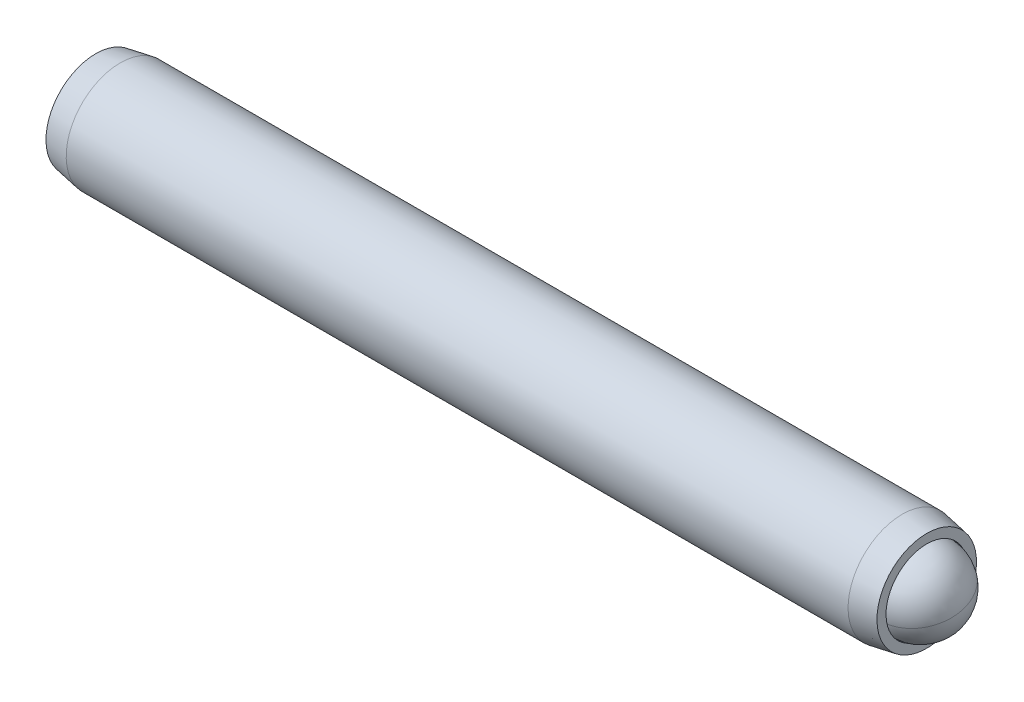
ISO-10303-21;
HEADER;
FILE_DESCRIPTION(('STEP AP214'),'2;1');
FILE_NAME('part.step','',(''),(''),'','','');
FILE_SCHEMA(('AUTOMOTIVE_DESIGN { 1 0 10303 214 1 1 1 1 }'));
ENDSEC;
DATA;
#1=APPLICATION_CONTEXT('core data for automotive mechanical design processes');
#2=APPLICATION_PROTOCOL_DEFINITION('international standard','automotive_design',2000,#1);
#3=PRODUCT_CONTEXT('',#1,'mechanical');
#4=PRODUCT('Part','Part','',(#3));
#5=PRODUCT_RELATED_PRODUCT_CATEGORY('part','',(#4));
#6=PRODUCT_DEFINITION_FORMATION('','',#4);
#7=PRODUCT_DEFINITION_CONTEXT('part definition',#1,'design');
#8=PRODUCT_DEFINITION('design','',#6,#7);
#9=PRODUCT_DEFINITION_SHAPE('','',#8);
#10=(LENGTH_UNIT() NAMED_UNIT(*) SI_UNIT(.MILLI.,.METRE.));
#11=(NAMED_UNIT(*) PLANE_ANGLE_UNIT() SI_UNIT($,.RADIAN.));
#12=(NAMED_UNIT(*) SI_UNIT($,.STERADIAN.) SOLID_ANGLE_UNIT());
#13=UNCERTAINTY_MEASURE_WITH_UNIT(LENGTH_MEASURE(1.E-05),#10,'distance_accuracy_value','');
#14=(GEOMETRIC_REPRESENTATION_CONTEXT(3) GLOBAL_UNCERTAINTY_ASSIGNED_CONTEXT((#13)) GLOBAL_UNIT_ASSIGNED_CONTEXT((#10,
#11,#12)) REPRESENTATION_CONTEXT('',''));
#15=CARTESIAN_POINT('',(0.,0.,0.));
#16=DIRECTION('',(0.,0.,1.));
#17=DIRECTION('',(1.,0.,0.));
#18=AXIS2_PLACEMENT_3D('',#15,#16,#17);
#19=CARTESIAN_POINT('',(-27.1013459470191,2.74204998828509,-0.965131231055238));
#20=DIRECTION('',(-1.,0.,0.));
#21=DIRECTION('',(0.,-1.,0.));
#22=AXIS2_PLACEMENT_3D('',#19,#20,#21);
#23=PLANE('',#22);
#24=DIRECTION('',(0.,0.866025403784439,-0.5));
#25=VECTOR('',#24,1.);
#26=CARTESIAN_POINT('',(-27.1013459470191,2.61504998828509,-2.33078112403965));
#27=LINE('',#26,#25);
#28=CARTESIAN_POINT('',(-27.1013459470191,1.49586248828509,-1.68461791964098));
#29=VERTEX_POINT('',#28);
#30=CARTESIAN_POINT('',(-27.1013459470191,2.74204998828508,-2.40410460822673));
#31=VERTEX_POINT('',#30);
#32=EDGE_CURVE('P0_E164',#29,#31,#27,.T.);
#33=ORIENTED_EDGE('',*,*,#32,.T.);
#34=DIRECTION('',(0.,0.866025403784439,0.5));
#35=VECTOR('',#34,1.);
#36=CARTESIAN_POINT('',(-27.1013459470191,3.86123748828508,-1.75794140382807));
#37=LINE('',#36,#35);
#38=CARTESIAN_POINT('',(-27.1013459470191,3.98823748828508,-1.68461791964098));
#39=VERTEX_POINT('',#38);
#40=EDGE_CURVE('P0_E166',#31,#39,#37,.T.);
#41=ORIENTED_EDGE('',*,*,#40,.T.);
#42=DIRECTION('',(0.,0.,1.));
#43=VECTOR('',#42,1.);
#44=CARTESIAN_POINT('',(-27.1013459470191,3.98823748828508,-0.392291510843657));
#45=LINE('',#44,#43);
#46=CARTESIAN_POINT('',(-27.1013459470191,3.98823748828508,-0.245644542469494));
#47=VERTEX_POINT('',#46);
#48=EDGE_CURVE('P0_E156',#39,#47,#45,.T.);
#49=ORIENTED_EDGE('',*,*,#48,.T.);
#50=DIRECTION('',(0.,-0.866025403784438,0.500000000000001));
#51=VECTOR('',#50,1.);
#52=CARTESIAN_POINT('',(-27.1013459470191,2.86904998828509,0.40051866192917));
#53=LINE('',#52,#51);
#54=CARTESIAN_POINT('',(-27.1013459470191,2.74204998828509,0.473842146116252));
#55=VERTEX_POINT('',#54);
#56=EDGE_CURVE('P0_E158',#47,#55,#53,.T.);
#57=ORIENTED_EDGE('',*,*,#56,.T.);
#58=DIRECTION('',(0.,-0.866025403784439,-0.5));
#59=VECTOR('',#58,1.);
#60=CARTESIAN_POINT('',(-27.1013459470191,1.62286248828509,-0.172321058282412));
#61=LINE('',#60,#59);
#62=CARTESIAN_POINT('',(-27.1013459470191,1.49586248828509,-0.245644542469493));
#63=VERTEX_POINT('',#62);
#64=EDGE_CURVE('P0_E160',#55,#63,#61,.T.);
#65=ORIENTED_EDGE('',*,*,#64,.T.);
#66=DIRECTION('',(0.,0.,-1.));
#67=VECTOR('',#66,1.);
#68=CARTESIAN_POINT('',(-27.1013459470191,1.49586248828509,-1.53797095126682));
#69=LINE('',#68,#67);
#70=EDGE_CURVE('P0_E162',#63,#29,#69,.T.);
#71=ORIENTED_EDGE('',*,*,#70,.T.);
#72=EDGE_LOOP('',(#33,#41,#49,#57,#65,#71));
#73=FACE_BOUND('',#72,.T.);
#74=CARTESIAN_POINT('',(-27.1013459470191,2.74204998828509,-0.965131231055238));
#75=DIRECTION('',(1.,0.,0.));
#76=DIRECTION('',(0.,1.,0.));
#77=AXIS2_PLACEMENT_3D('',#74,#75,#76);
#78=CIRCLE('',#77,2.921);
#79=CARTESIAN_POINT('',(-27.1013459470191,5.66304998828509,-0.965131231055238));
#80=VERTEX_POINT('',#79);
#81=EDGE_CURVE('P0_E150',#80,#80,#78,.T.);
#82=ORIENTED_EDGE('',*,*,#81,.F.);
#83=EDGE_LOOP('',(#82));
#84=FACE_BOUND('',#83,.T.);
#85=ADVANCED_FACE('P0_F17',(#73,#84),#23,.T.);
#86=CARTESIAN_POINT('',(-25.6608403648362,2.74204998828509,-0.965131231055238));
#87=DIRECTION('',(1.,0.,0.));
#88=DIRECTION('',(0.,1.,0.));
#89=AXIS2_PLACEMENT_3D('',#86,#87,#88);
#90=CONICAL_SURFACE('',#89,3.175,0.174532925199434);
#91=ORIENTED_EDGE('',*,*,#81,.T.);
#92=EDGE_LOOP('',(#91));
#93=FACE_BOUND('',#92,.T.);
#94=CARTESIAN_POINT('',(-25.6608403648362,2.74204998828509,-0.965131231055238));
#95=DIRECTION('',(1.,0.,0.));
#96=DIRECTION('',(0.,1.,0.));
#97=AXIS2_PLACEMENT_3D('',#94,#95,#96);
#98=CIRCLE('',#97,3.175);
#99=CARTESIAN_POINT('',(-25.6608403648362,5.91704998828509,-0.965131231055238));
#100=VERTEX_POINT('',#99);
#101=EDGE_CURVE('P0_E147',#100,#100,#98,.T.);
#102=ORIENTED_EDGE('',*,*,#101,.F.);
#103=EDGE_LOOP('',(#102));
#104=FACE_BOUND('',#103,.T.);
#105=ADVANCED_FACE('P0_F225',(#93,#104),#90,.T.);
#106=CARTESIAN_POINT('',(17.94980800758,2.7420499882851,-0.965131231055238));
#107=DIRECTION('',(1.,0.,0.));
#108=DIRECTION('',(0.,1.,0.));
#109=AXIS2_PLACEMENT_3D('',#106,#107,#108);
#110=CYLINDRICAL_SURFACE('',#109,3.175);
#111=ORIENTED_EDGE('',*,*,#101,.T.);
#112=EDGE_LOOP('',(#111));
#113=FACE_BOUND('',#112,.T.);
#114=CARTESIAN_POINT('',(20.226148470798,2.7420499882851,-0.965131231055238));
#115=DIRECTION('',(1.,0.,0.));
#116=DIRECTION('',(0.,1.,0.));
#117=AXIS2_PLACEMENT_3D('',#114,#115,#116);
#118=CIRCLE('',#117,3.17499999999999);
#119=CARTESIAN_POINT('',(20.226148470798,5.91704998828509,-0.965131231055238));
#120=VERTEX_POINT('',#119);
#121=EDGE_CURVE('P0_E144',#120,#120,#118,.T.);
#122=ORIENTED_EDGE('',*,*,#121,.F.);
#123=EDGE_LOOP('',(#122));
#124=FACE_BOUND('',#123,.T.);
#125=ADVANCED_FACE('P0_F231',(#113,#124),#110,.T.);
#126=CARTESIAN_POINT('',(21.6666540529809,2.7420499882851,-0.965131231055238));
#127=DIRECTION('',(-1.,0.,0.));
#128=DIRECTION('',(0.,-1.,0.));
#129=AXIS2_PLACEMENT_3D('',#126,#127,#128);
#130=CONICAL_SURFACE('',#129,2.92099999999999,0.174532925199435);
#131=ORIENTED_EDGE('',*,*,#121,.T.);
#132=EDGE_LOOP('',(#131));
#133=FACE_BOUND('',#132,.T.);
#134=CARTESIAN_POINT('',(21.6666540529809,2.7420499882851,-0.965131231055238));
#135=DIRECTION('',(1.,0.,0.));
#136=DIRECTION('',(0.,1.,0.));
#137=AXIS2_PLACEMENT_3D('',#134,#135,#136);
#138=CIRCLE('',#137,2.92099999999999);
#139=CARTESIAN_POINT('',(21.6666540529809,5.66304998828509,-0.965131231055238));
#140=VERTEX_POINT('',#139);
#141=EDGE_CURVE('P0_E141',#140,#140,#138,.T.);
#142=ORIENTED_EDGE('',*,*,#141,.F.);
#143=EDGE_LOOP('',(#142));
#144=FACE_BOUND('',#143,.T.);
#145=ADVANCED_FACE('P0_F275',(#133,#144),#130,.T.);
#146=CARTESIAN_POINT('',(21.6666540529809,5.66304998828509,-0.965131231055238));
#147=DIRECTION('',(1.,0.,0.));
#148=DIRECTION('',(0.,1.,0.));
#149=AXIS2_PLACEMENT_3D('',#146,#147,#148);
#150=PLANE('',#149);
#151=ORIENTED_EDGE('',*,*,#141,.T.);
#152=EDGE_LOOP('',(#151));
#153=FACE_BOUND('',#152,.T.);
#154=CARTESIAN_POINT('',(21.6666540529809,2.7420499882851,-0.965131231055238));
#155=DIRECTION('',(1.,0.,0.));
#156=DIRECTION('',(0.,1.,0.));
#157=AXIS2_PLACEMENT_3D('',#154,#155,#156);
#158=CIRCLE('',#157,2.3876);
#159=CARTESIAN_POINT('',(21.6666540529809,5.1296499882851,-0.965131231055238));
#160=VERTEX_POINT('',#159);
#161=EDGE_CURVE('P0_E138',#160,#160,#158,.T.);
#162=ORIENTED_EDGE('',*,*,#161,.F.);
#163=EDGE_LOOP('',(#162));
#164=FACE_BOUND('',#163,.T.);
#165=ADVANCED_FACE('P0_F271',(#153,#164),#150,.T.);
#166=CARTESIAN_POINT('',(17.94980800758,2.7420499882851,-0.965131231055238));
#167=DIRECTION('',(1.,0.,0.));
#168=DIRECTION('',(0.,1.,0.));
#169=AXIS2_PLACEMENT_3D('',#166,#167,#168);
#170=CYLINDRICAL_SURFACE('',#169,2.3876);
#171=ORIENTED_EDGE('',*,*,#161,.T.);
#172=EDGE_LOOP('',(#171));
#173=FACE_BOUND('',#172,.T.);
#174=CARTESIAN_POINT('',(20.33740800758,2.7420499882851,-0.965131231055238));
#175=DIRECTION('',(1.,0.,0.));
#176=DIRECTION('',(0.,1.,0.));
#177=AXIS2_PLACEMENT_3D('',#174,#175,#176);
#178=CIRCLE('',#177,2.3876);
#179=CARTESIAN_POINT('',(20.33740800758,5.1296499882851,-0.965131231055238));
#180=VERTEX_POINT('',#179);
#181=EDGE_CURVE('P0_E126',#180,#180,#178,.T.);
#182=ORIENTED_EDGE('',*,*,#181,.F.);
#183=EDGE_LOOP('',(#182));
#184=FACE_BOUND('',#183,.T.);
#185=ADVANCED_FACE('P0_F267',(#173,#184),#170,.F.);
#186=CARTESIAN_POINT('',(17.94980800758,2.7420499882851,-0.965131231055238));
#187=DIRECTION('',(1.,0.,0.));
#188=DIRECTION('',(0.,1.,0.));
#189=AXIS2_PLACEMENT_3D('',#186,#187,#188);
#190=CONICAL_SURFACE('',#189,0.,0.78539816339745);
#191=ORIENTED_EDGE('',*,*,#181,.T.);
#192=EDGE_LOOP('',(#191));
#193=FACE_BOUND('',#192,.T.);
#194=CARTESIAN_POINT('',(17.94980800758,2.7420499882851,-0.965131231055238));
#195=VERTEX_POINT('',#194);
#196=VERTEX_LOOP('',#195);
#197=FACE_BOUND('',#196,.T.);
#198=ADVANCED_FACE('P0_F221',(#193,#197),#190,.F.);
#199=CARTESIAN_POINT('',(-24.0533459470191,2.74204998828509,0.180548209367925));
#200=DIRECTION('',(0.,0.5,0.866025403784438));
#201=DIRECTION('',(0.,-0.866025403784438,0.500000000000001));
#202=AXIS2_PLACEMENT_3D('',#199,#200,#201);
#203=PLANE('',#202);
#204=DIRECTION('',(-1.,0.,0.));
#205=VECTOR('',#204,1.);
#206=CARTESIAN_POINT('',(-24.0533459470191,2.74204998828509,0.180548209367925));
#207=LINE('',#206,#205);
#208=CARTESIAN_POINT('',(-24.0533459470191,2.74204998828509,0.180548209367925));
#209=VERTEX_POINT('',#208);
#210=CARTESIAN_POINT('',(-26.8473459470191,2.74204998828509,0.180548209367925));
#211=VERTEX_POINT('',#210);
#212=EDGE_CURVE('P0_E124',#209,#211,#207,.T.);
#213=ORIENTED_EDGE('',*,*,#212,.T.);
#214=DIRECTION('',(0.,0.866025403784438,-0.500000000000001));
#215=VECTOR('',#214,1.);
#216=CARTESIAN_POINT('',(-26.8473459470191,3.73423748828509,-0.392291510843657));
#217=LINE('',#216,#215);
#218=CARTESIAN_POINT('',(-26.8473459470191,3.73423748828509,-0.392291510843657));
#219=VERTEX_POINT('',#218);
#220=EDGE_CURVE('P0_E26',#211,#219,#217,.T.);
#221=ORIENTED_EDGE('',*,*,#220,.T.);
#222=DIRECTION('',(-1.,0.,0.));
#223=VECTOR('',#222,1.);
#224=CARTESIAN_POINT('',(-24.0533459470191,3.73423748828509,-0.392291510843657));
#225=LINE('',#224,#223);
#226=CARTESIAN_POINT('',(-24.0533459470191,3.73423748828509,-0.392291510843657));
#227=VERTEX_POINT('',#226);
#228=EDGE_CURVE('P0_E90',#227,#219,#225,.T.);
#229=ORIENTED_EDGE('',*,*,#228,.F.);
#230=DIRECTION('',(0.,0.866025403784438,-0.5));
#231=VECTOR('',#230,1.);
#232=CARTESIAN_POINT('',(-24.0533459470191,2.74204998828509,0.180548209367925));
#233=LINE('',#232,#231);
#234=EDGE_CURVE('P0_E94',#209,#227,#233,.T.);
#235=ORIENTED_EDGE('',*,*,#234,.F.);
#236=EDGE_LOOP('',(#213,#221,#229,#235));
#237=FACE_BOUND('',#236,.T.);
#238=ADVANCED_FACE('P0_F92',(#237),#203,.F.);
#239=CARTESIAN_POINT('',(-24.0533459470191,1.74986248828508,-0.392291510843657));
#240=DIRECTION('',(0.,-0.499999999999999,0.866025403784439));
#241=DIRECTION('',(0.,-0.866025403784439,-0.5));
#242=AXIS2_PLACEMENT_3D('',#239,#240,#241);
#243=PLANE('',#242);
#244=DIRECTION('',(-1.,0.,0.));
#245=VECTOR('',#244,1.);
#246=CARTESIAN_POINT('',(-24.0533459470191,1.74986248828508,-0.392291510843657));
#247=LINE('',#246,#245);
#248=CARTESIAN_POINT('',(-24.0533459470191,1.74986248828508,-0.392291510843657));
#249=VERTEX_POINT('',#248);
#250=CARTESIAN_POINT('',(-26.8473459470191,1.74986248828508,-0.392291510843657));
#251=VERTEX_POINT('',#250);
#252=EDGE_CURVE('P0_E127',#249,#251,#247,.T.);
#253=ORIENTED_EDGE('',*,*,#252,.T.);
#254=DIRECTION('',(0.,0.866025403784439,0.5));
#255=VECTOR('',#254,1.);
#256=CARTESIAN_POINT('',(-26.8473459470191,2.74204998828509,0.180548209367925));
#257=LINE('',#256,#255);
#258=EDGE_CURVE('P0_E41',#251,#211,#257,.T.);
#259=ORIENTED_EDGE('',*,*,#258,.T.);
#260=ORIENTED_EDGE('',*,*,#212,.F.);
#261=DIRECTION('',(0.,0.866025403784439,0.499999999999999));
#262=VECTOR('',#261,1.);
#263=CARTESIAN_POINT('',(-24.0533459470191,1.74986248828508,-0.392291510843657));
#264=LINE('',#263,#262);
#265=EDGE_CURVE('P0_E99',#249,#209,#264,.T.);
#266=ORIENTED_EDGE('',*,*,#265,.F.);
#267=EDGE_LOOP('',(#253,#259,#260,#266));
#268=FACE_BOUND('',#267,.T.);
#269=ADVANCED_FACE('P0_F212',(#268),#243,.F.);
#270=CARTESIAN_POINT('',(-24.0533459470191,1.74986248828508,-1.53797095126682));
#271=DIRECTION('',(0.,-1.,0.));
#272=DIRECTION('',(0.,0.,-1.));
#273=AXIS2_PLACEMENT_3D('',#270,#271,#272);
#274=PLANE('',#273);
#275=DIRECTION('',(-1.,0.,0.));
#276=VECTOR('',#275,1.);
#277=CARTESIAN_POINT('',(-24.0533459470191,1.74986248828508,-1.53797095126682));
#278=LINE('',#277,#276);
#279=CARTESIAN_POINT('',(-24.0533459470191,1.74986248828508,-1.53797095126682));
#280=VERTEX_POINT('',#279);
#281=CARTESIAN_POINT('',(-26.8473459470191,1.74986248828508,-1.53797095126682));
#282=VERTEX_POINT('',#281);
#283=EDGE_CURVE('P0_E129',#280,#282,#278,.T.);
#284=ORIENTED_EDGE('',*,*,#283,.T.);
#285=DIRECTION('',(0.,0.,1.));
#286=VECTOR('',#285,1.);
#287=CARTESIAN_POINT('',(-26.8473459470191,1.74986248828508,-0.392291510843657));
#288=LINE('',#287,#286);
#289=EDGE_CURVE('P0_E171',#282,#251,#288,.T.);
#290=ORIENTED_EDGE('',*,*,#289,.T.);
#291=ORIENTED_EDGE('',*,*,#252,.F.);
#292=DIRECTION('',(0.,0.,1.));
#293=VECTOR('',#292,1.);
#294=CARTESIAN_POINT('',(-24.0533459470191,1.74986248828508,-1.53797095126682));
#295=LINE('',#294,#293);
#296=EDGE_CURVE('P0_E121',#280,#249,#295,.T.);
#297=ORIENTED_EDGE('',*,*,#296,.F.);
#298=EDGE_LOOP('',(#284,#290,#291,#297));
#299=FACE_BOUND('',#298,.T.);
#300=ADVANCED_FACE('P0_F211',(#299),#274,.F.);
#301=CARTESIAN_POINT('',(-24.0533459470191,2.74204998828508,-2.1108106714784));
#302=DIRECTION('',(0.,-0.5,-0.866025403784438));
#303=DIRECTION('',(0.,0.866025403784439,-0.5));
#304=AXIS2_PLACEMENT_3D('',#301,#302,#303);
#305=PLANE('',#304);
#306=DIRECTION('',(-1.,0.,0.));
#307=VECTOR('',#306,1.);
#308=CARTESIAN_POINT('',(-24.0533459470191,2.74204998828508,-2.1108106714784));
#309=LINE('',#308,#307);
#310=CARTESIAN_POINT('',(-24.0533459470191,2.74204998828508,-2.1108106714784));
#311=VERTEX_POINT('',#310);
#312=CARTESIAN_POINT('',(-26.8473459470191,2.74204998828508,-2.1108106714784));
#313=VERTEX_POINT('',#312);
#314=EDGE_CURVE('P0_E132',#311,#313,#309,.T.);
#315=ORIENTED_EDGE('',*,*,#314,.T.);
#316=DIRECTION('',(0.,-0.866025403784439,0.5));
#317=VECTOR('',#316,1.);
#318=CARTESIAN_POINT('',(-26.8473459470191,1.74986248828508,-1.53797095126682));
#319=LINE('',#318,#317);
#320=EDGE_CURVE('P0_E169',#313,#282,#319,.T.);
#321=ORIENTED_EDGE('',*,*,#320,.T.);
#322=ORIENTED_EDGE('',*,*,#283,.F.);
#323=DIRECTION('',(0.,-0.866025403784438,0.5));
#324=VECTOR('',#323,1.);
#325=CARTESIAN_POINT('',(-24.0533459470191,2.74204998828508,-2.1108106714784));
#326=LINE('',#325,#324);
#327=EDGE_CURVE('P0_E118',#311,#280,#326,.T.);
#328=ORIENTED_EDGE('',*,*,#327,.F.);
#329=EDGE_LOOP('',(#315,#321,#322,#328));
#330=FACE_BOUND('',#329,.T.);
#331=ADVANCED_FACE('P0_F208',(#330),#305,.F.);
#332=CARTESIAN_POINT('',(-24.0533459470191,3.73423748828509,-1.53797095126682));
#333=DIRECTION('',(0.,0.5,-0.866025403784439));
#334=DIRECTION('',(0.,0.866025403784439,0.5));
#335=AXIS2_PLACEMENT_3D('',#332,#333,#334);
#336=PLANE('',#335);
#337=DIRECTION('',(-1.,0.,0.));
#338=VECTOR('',#337,1.);
#339=CARTESIAN_POINT('',(-24.0533459470191,3.73423748828509,-1.53797095126682));
#340=LINE('',#339,#338);
#341=CARTESIAN_POINT('',(-24.0533459470191,3.73423748828509,-1.53797095126682));
#342=VERTEX_POINT('',#341);
#343=CARTESIAN_POINT('',(-26.8473459470191,3.73423748828509,-1.53797095126682));
#344=VERTEX_POINT('',#343);
#345=EDGE_CURVE('P0_E98',#342,#344,#340,.T.);
#346=ORIENTED_EDGE('',*,*,#345,.T.);
#347=DIRECTION('',(0.,-0.866025403784439,-0.5));
#348=VECTOR('',#347,1.);
#349=CARTESIAN_POINT('',(-26.8473459470191,2.74204998828508,-2.1108106714784));
#350=LINE('',#349,#348);
#351=EDGE_CURVE('P0_E153',#344,#313,#350,.T.);
#352=ORIENTED_EDGE('',*,*,#351,.T.);
#353=ORIENTED_EDGE('',*,*,#314,.F.);
#354=DIRECTION('',(0.,-0.866025403784439,-0.5));
#355=VECTOR('',#354,1.);
#356=CARTESIAN_POINT('',(-24.0533459470191,3.73423748828509,-1.53797095126682));
#357=LINE('',#356,#355);
#358=EDGE_CURVE('P0_E108',#342,#311,#357,.T.);
#359=ORIENTED_EDGE('',*,*,#358,.F.);
#360=EDGE_LOOP('',(#346,#352,#353,#359));
#361=FACE_BOUND('',#360,.T.);
#362=ADVANCED_FACE('P0_F204',(#361),#336,.F.);
#363=CARTESIAN_POINT('',(-24.0533459470191,3.73423748828509,-0.392291510843657));
#364=DIRECTION('',(0.,1.,0.));
#365=DIRECTION('',(-1.,0.,0.));
#366=AXIS2_PLACEMENT_3D('',#363,#364,#365);
#367=PLANE('',#366);
#368=ORIENTED_EDGE('',*,*,#228,.T.);
#369=DIRECTION('',(0.,0.,-1.));
#370=VECTOR('',#369,1.);
#371=CARTESIAN_POINT('',(-26.8473459470191,3.73423748828509,-1.53797095126682));
#372=LINE('',#371,#370);
#373=EDGE_CURVE('P0_E11',#219,#344,#372,.T.);
#374=ORIENTED_EDGE('',*,*,#373,.T.);
#375=ORIENTED_EDGE('',*,*,#345,.F.);
#376=DIRECTION('',(0.,0.,-1.));
#377=VECTOR('',#376,1.);
#378=CARTESIAN_POINT('',(-24.0533459470191,3.73423748828509,-0.392291510843657));
#379=LINE('',#378,#377);
#380=EDGE_CURVE('P0_E102',#227,#342,#379,.T.);
#381=ORIENTED_EDGE('',*,*,#380,.F.);
#382=EDGE_LOOP('',(#368,#374,#375,#381));
#383=FACE_BOUND('',#382,.T.);
#384=ADVANCED_FACE('P0_F103',(#383),#367,.F.);
#385=CARTESIAN_POINT('',(-24.0533459470191,4.72642498828509,-0.96513123105524));
#386=DIRECTION('',(-1.,0.,0.));
#387=DIRECTION('',(0.,0.,1.));
#388=AXIS2_PLACEMENT_3D('',#385,#386,#387);
#389=PLANE('',#388);
#390=ORIENTED_EDGE('',*,*,#234,.T.);
#391=ORIENTED_EDGE('',*,*,#380,.T.);
#392=ORIENTED_EDGE('',*,*,#358,.T.);
#393=ORIENTED_EDGE('',*,*,#327,.T.);
#394=ORIENTED_EDGE('',*,*,#296,.T.);
#395=ORIENTED_EDGE('',*,*,#265,.T.);
#396=EDGE_LOOP('',(#390,#391,#392,#393,#394,#395));
#397=FACE_BOUND('',#396,.T.);
#398=ADVANCED_FACE('P0_F110',(#397),#389,.T.);
#399=CARTESIAN_POINT('',(-26.8473459470191,1.74986248828508,-0.392291510843657));
#400=DIRECTION('',(-0.707106781186548,0.353553390593273,-0.612372435695795));
#401=DIRECTION('',(-0.654653670707977,0.,0.755928946018455));
#402=AXIS2_PLACEMENT_3D('',#399,#400,#401);
#403=PLANE('',#402);
#404=DIRECTION('',(-0.654653670707977,-0.654653670707977,0.377964473009228));
#405=VECTOR('',#404,1.);
#406=CARTESIAN_POINT('',(-26.563863804162,2.03334463114223,-0.555960002332681));
#407=LINE('',#406,#405);
#408=EDGE_CURVE('P0_E115',#63,#251,#407,.F.);
#409=ORIENTED_EDGE('',*,*,#408,.F.);
#410=ORIENTED_EDGE('',*,*,#64,.F.);
#411=DIRECTION('',(-0.654653670707977,0.,0.755928946018455));
#412=VECTOR('',#411,1.);
#413=CARTESIAN_POINT('',(-26.563863804162,2.74204998828509,-0.146788773610122));
#414=LINE('',#413,#412);
#415=EDGE_CURVE('P0_E21',#211,#55,#414,.T.);
#416=ORIENTED_EDGE('',*,*,#415,.F.);
#417=ORIENTED_EDGE('',*,*,#258,.F.);
#418=EDGE_LOOP('',(#409,#410,#416,#417));
#419=FACE_BOUND('',#418,.T.);
#420=ADVANCED_FACE('P0_F19',(#419),#403,.T.);
#421=CARTESIAN_POINT('',(-26.8473459470191,2.74204998828509,0.180548209367925));
#422=DIRECTION('',(-0.707106781186548,-0.353553390593274,-0.612372435695794));
#423=DIRECTION('',(-0.654653670707977,0.,0.755928946018455));
#424=AXIS2_PLACEMENT_3D('',#421,#422,#423);
#425=PLANE('',#424);
#426=ORIENTED_EDGE('',*,*,#415,.T.);
#427=ORIENTED_EDGE('',*,*,#56,.F.);
#428=DIRECTION('',(-0.654653670707977,0.654653670707977,0.377964473009227));
#429=VECTOR('',#428,1.);
#430=CARTESIAN_POINT('',(-26.563863804162,3.45075534542794,-0.55596000233268));
#431=LINE('',#430,#429);
#432=EDGE_CURVE('P0_E182',#219,#47,#431,.T.);
#433=ORIENTED_EDGE('',*,*,#432,.F.);
#434=ORIENTED_EDGE('',*,*,#220,.F.);
#435=EDGE_LOOP('',(#426,#427,#433,#434));
#436=FACE_BOUND('',#435,.T.);
#437=ADVANCED_FACE('P0_F196',(#436),#425,.T.);
#438=CARTESIAN_POINT('',(-26.8473459470191,1.74986248828508,-1.53797095126682));
#439=DIRECTION('',(-0.707106781186547,0.707106781186548,0.));
#440=DIRECTION('',(-0.707106781186548,-0.707106781186547,0.));
#441=AXIS2_PLACEMENT_3D('',#438,#439,#440);
#442=PLANE('',#441);
#443=ORIENTED_EDGE('',*,*,#408,.T.);
#444=ORIENTED_EDGE('',*,*,#289,.F.);
#445=DIRECTION('',(-0.654653670707977,-0.654653670707977,-0.377964473009227));
#446=VECTOR('',#445,1.);
#447=CARTESIAN_POINT('',(-26.563863804162,2.03334463114223,-1.3743024597778));
#448=LINE('',#447,#446);
#449=EDGE_CURVE('P0_E179',#29,#282,#448,.F.);
#450=ORIENTED_EDGE('',*,*,#449,.F.);
#451=ORIENTED_EDGE('',*,*,#70,.F.);
#452=EDGE_LOOP('',(#443,#444,#450,#451));
#453=FACE_BOUND('',#452,.T.);
#454=ADVANCED_FACE('P0_F189',(#453),#442,.T.);
#455=CARTESIAN_POINT('',(-26.8473459470191,3.73423748828509,-0.392291510843657));
#456=DIRECTION('',(-0.707106781186548,-0.707106781186548,0.));
#457=DIRECTION('',(0.707106781186548,-0.707106781186548,0.));
#458=AXIS2_PLACEMENT_3D('',#455,#456,#457);
#459=PLANE('',#458);
#460=ORIENTED_EDGE('',*,*,#432,.T.);
#461=ORIENTED_EDGE('',*,*,#48,.F.);
#462=DIRECTION('',(0.654653670707977,-0.654653670707977,0.377964473009228));
#463=VECTOR('',#462,1.);
#464=CARTESIAN_POINT('',(-26.8473459470191,3.73423748828509,-1.53797095126682));
#465=LINE('',#464,#463);
#466=EDGE_CURVE('P0_E177',#344,#39,#465,.F.);
#467=ORIENTED_EDGE('',*,*,#466,.F.);
#468=ORIENTED_EDGE('',*,*,#373,.F.);
#469=EDGE_LOOP('',(#460,#461,#467,#468));
#470=FACE_BOUND('',#469,.T.);
#471=ADVANCED_FACE('P0_F201',(#470),#459,.T.);
#472=CARTESIAN_POINT('',(-26.8473459470191,2.74204998828508,-2.1108106714784));
#473=DIRECTION('',(-0.707106781186547,0.353553390593274,0.612372435695795));
#474=DIRECTION('',(0.654653670707977,0.,0.755928946018454));
#475=AXIS2_PLACEMENT_3D('',#472,#473,#474);
#476=PLANE('',#475);
#477=ORIENTED_EDGE('',*,*,#449,.T.);
#478=ORIENTED_EDGE('',*,*,#320,.F.);
#479=DIRECTION('',(-0.654653670707977,0.,-0.755928946018454));
#480=VECTOR('',#479,1.);
#481=CARTESIAN_POINT('',(-26.563863804162,2.74204998828508,-1.78347368850036));
#482=LINE('',#481,#480);
#483=EDGE_CURVE('P0_E175',#31,#313,#482,.F.);
#484=ORIENTED_EDGE('',*,*,#483,.F.);
#485=ORIENTED_EDGE('',*,*,#32,.F.);
#486=EDGE_LOOP('',(#477,#478,#484,#485));
#487=FACE_BOUND('',#486,.T.);
#488=ADVANCED_FACE('P0_F240',(#487),#476,.T.);
#489=CARTESIAN_POINT('',(-26.8473459470191,3.73423748828509,-1.53797095126682));
#490=DIRECTION('',(-0.707106781186548,-0.353553390593274,0.612372435695795));
#491=DIRECTION('',(0.654653670707977,0.,0.755928946018455));
#492=AXIS2_PLACEMENT_3D('',#489,#490,#491);
#493=PLANE('',#492);
#494=ORIENTED_EDGE('',*,*,#466,.T.);
#495=ORIENTED_EDGE('',*,*,#40,.F.);
#496=ORIENTED_EDGE('',*,*,#483,.T.);
#497=ORIENTED_EDGE('',*,*,#351,.F.);
#498=EDGE_LOOP('',(#494,#495,#496,#497));
#499=FACE_BOUND('',#498,.T.);
#500=ADVANCED_FACE('P0_F237',(#499),#493,.T.);
#501=CLOSED_SHELL('',(#85,#105,#125,#145,#165,#185,#198,#238,#269,#300,#331,#362,#384,#398,#420,
#437,#454,#471,#488,#500));
#502=MANIFOLD_SOLID_BREP('P0_B1',#501);
#503=CARTESIAN_POINT('',(21.3174040529809,2.74204998828509,-0.965131231055239));
#504=DIRECTION('',(0.,0.972214232741158,0.234092899626454));
#505=DIRECTION('',(0.,0.234092899626454,-0.972214232741158));
#506=AXIS2_PLACEMENT_3D('',#503,#504,#505);
#507=SPHERICAL_SURFACE('',#506,2.38125);
#508=CARTESIAN_POINT('',(21.3174040529809,2.74204998828509,-0.965131231055239));
#509=DIRECTION('',(1.,0.,0.));
#510=DIRECTION('',(0.,0.234092899626454,-0.972214232741158));
#511=AXIS2_PLACEMENT_3D('',#508,#509,#510);
#512=CIRCLE('',#511,2.38125);
#513=CARTESIAN_POINT('',(21.3174040529809,3.29948370552059,-3.28021637277012));
#514=VERTEX_POINT('',#513);
#515=CARTESIAN_POINT('',(21.3174040529809,2.1846162710496,1.34995391065964));
#516=VERTEX_POINT('',#515);
#517=EDGE_CURVE('P1_E33',#514,#516,#512,.T.);
#518=ORIENTED_EDGE('',*,*,#517,.T.);
#519=CARTESIAN_POINT('',(21.3174040529809,2.74204998828509,-0.965131231055239));
#520=DIRECTION('',(0.,0.972214232741158,0.234092899626454));
#521=DIRECTION('',(1.,0.,0.));
#522=AXIS2_PLACEMENT_3D('',#519,#520,#521);
#523=CIRCLE('',#522,2.38125);
#524=EDGE_CURVE('P1_E10',#516,#514,#523,.T.);
#525=ORIENTED_EDGE('',*,*,#524,.T.);
#526=EDGE_LOOP('',(#518,#525));
#527=FACE_BOUND('',#526,.T.);
#528=ADVANCED_FACE('P1_F16',(#527),#507,.T.);
#529=ORIENTED_EDGE('',*,*,#517,.F.);
#530=CARTESIAN_POINT('',(21.3174040529809,2.74204998828509,-0.965131231055239));
#531=DIRECTION('',(0.,0.972214232741158,0.234092899626454));
#532=DIRECTION('',(1.,0.,0.));
#533=AXIS2_PLACEMENT_3D('',#530,#531,#532);
#534=CIRCLE('',#533,2.38125);
#535=EDGE_CURVE('P1_E23',#514,#516,#534,.T.);
#536=ORIENTED_EDGE('',*,*,#535,.T.);
#537=EDGE_LOOP('',(#529,#536));
#538=FACE_BOUND('',#537,.T.);
#539=ADVANCED_FACE('P1_F40',(#538),#507,.T.);
#540=ORIENTED_EDGE('',*,*,#524,.F.);
#541=EDGE_CURVE('P1_E36',#516,#514,#512,.T.);
#542=ORIENTED_EDGE('',*,*,#541,.T.);
#543=EDGE_LOOP('',(#540,#542));
#544=FACE_BOUND('',#543,.T.);
#545=ADVANCED_FACE('P1_F38',(#544),#507,.T.);
#546=ORIENTED_EDGE('',*,*,#535,.F.);
#547=ORIENTED_EDGE('',*,*,#541,.F.);
#548=EDGE_LOOP('',(#546,#547));
#549=FACE_BOUND('',#548,.T.);
#550=ADVANCED_FACE('P1_F18',(#549),#507,.T.);
#551=CLOSED_SHELL('',(#528,#539,#545,#550));
#552=MANIFOLD_SOLID_BREP('P1_B1',#551);
#553=ADVANCED_BREP_SHAPE_REPRESENTATION('',(#18,#502,#552),#14);
#554=SHAPE_DEFINITION_REPRESENTATION(#9,#553);
ENDSEC;
END-ISO-10303-21;
